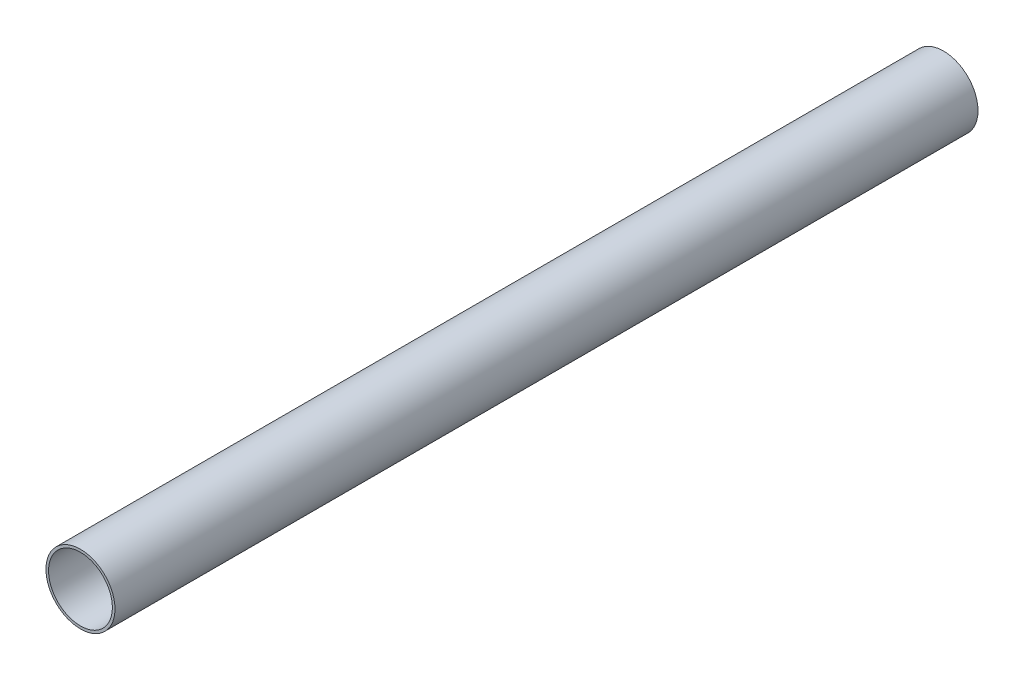
ISO-10303-21;
HEADER;
FILE_DESCRIPTION(('STEP AP214'),'2;1');
FILE_NAME('part.step','',(''),(''),'','','');
FILE_SCHEMA(('AUTOMOTIVE_DESIGN { 1 0 10303 214 1 1 1 1 }'));
ENDSEC;
DATA;
#1=APPLICATION_CONTEXT('core data for automotive mechanical design processes');
#2=APPLICATION_PROTOCOL_DEFINITION('international standard','automotive_design',2000,#1);
#3=PRODUCT_CONTEXT('',#1,'mechanical');
#4=PRODUCT('Part','Part','',(#3));
#5=PRODUCT_RELATED_PRODUCT_CATEGORY('part','',(#4));
#6=PRODUCT_DEFINITION_FORMATION('','',#4);
#7=PRODUCT_DEFINITION_CONTEXT('part definition',#1,'design');
#8=PRODUCT_DEFINITION('design','',#6,#7);
#9=PRODUCT_DEFINITION_SHAPE('','',#8);
#10=(LENGTH_UNIT() NAMED_UNIT(*) SI_UNIT(.MILLI.,.METRE.));
#11=(NAMED_UNIT(*) PLANE_ANGLE_UNIT() SI_UNIT($,.RADIAN.));
#12=(NAMED_UNIT(*) SI_UNIT($,.STERADIAN.) SOLID_ANGLE_UNIT());
#13=UNCERTAINTY_MEASURE_WITH_UNIT(LENGTH_MEASURE(1.E-05),#10,'distance_accuracy_value','');
#14=(GEOMETRIC_REPRESENTATION_CONTEXT(3) GLOBAL_UNCERTAINTY_ASSIGNED_CONTEXT((#13)) GLOBAL_UNIT_ASSIGNED_CONTEXT((#10,
#11,#12)) REPRESENTATION_CONTEXT('',''));
#15=CARTESIAN_POINT('',(0.,0.,0.));
#16=DIRECTION('',(0.,0.,1.));
#17=DIRECTION('',(1.,0.,0.));
#18=AXIS2_PLACEMENT_3D('',#15,#16,#17);
#19=CARTESIAN_POINT('',(0.,0.,500.));
#20=DIRECTION('',(0.,0.,1.));
#21=DIRECTION('',(1.,0.,0.));
#22=AXIS2_PLACEMENT_3D('',#19,#20,#21);
#23=PLANE('',#22);
#24=CARTESIAN_POINT('',(0.,0.,500.));
#25=DIRECTION('',(0.,0.,1.));
#26=DIRECTION('',(1.,0.,0.));
#27=AXIS2_PLACEMENT_3D('',#24,#25,#26);
#28=CIRCLE('',#27,20.);
#29=CARTESIAN_POINT('',(20.,0.,500.));
#30=VERTEX_POINT('',#29);
#31=EDGE_CURVE('E10',#30,#30,#28,.T.);
#32=ORIENTED_EDGE('',*,*,#31,.T.);
#33=EDGE_LOOP('',(#32));
#34=FACE_BOUND('',#33,.T.);
#35=CARTESIAN_POINT('',(0.,0.,500.));
#36=DIRECTION('',(0.,0.,1.));
#37=DIRECTION('',(1.,0.,0.));
#38=AXIS2_PLACEMENT_3D('',#35,#36,#37);
#39=CIRCLE('',#38,18.5);
#40=CARTESIAN_POINT('',(18.5,0.,500.));
#41=VERTEX_POINT('',#40);
#42=EDGE_CURVE('E50',#41,#41,#39,.T.);
#43=ORIENTED_EDGE('',*,*,#42,.F.);
#44=EDGE_LOOP('',(#43));
#45=FACE_BOUND('',#44,.T.);
#46=ADVANCED_FACE('F37',(#34,#45),#23,.T.);
#47=CARTESIAN_POINT('',(0.,0.,0.));
#48=DIRECTION('',(0.,0.,1.));
#49=DIRECTION('',(1.,0.,0.));
#50=AXIS2_PLACEMENT_3D('',#47,#48,#49);
#51=PLANE('',#50);
#52=CARTESIAN_POINT('',(0.,0.,0.));
#53=DIRECTION('',(0.,0.,1.));
#54=DIRECTION('',(1.,0.,0.));
#55=AXIS2_PLACEMENT_3D('',#52,#53,#54);
#56=CIRCLE('',#55,20.);
#57=CARTESIAN_POINT('',(20.,0.,0.));
#58=VERTEX_POINT('',#57);
#59=EDGE_CURVE('E41',#58,#58,#56,.T.);
#60=ORIENTED_EDGE('',*,*,#59,.F.);
#61=EDGE_LOOP('',(#60));
#62=FACE_BOUND('',#61,.T.);
#63=CARTESIAN_POINT('',(0.,0.,0.));
#64=DIRECTION('',(0.,0.,1.));
#65=DIRECTION('',(1.,0.,0.));
#66=AXIS2_PLACEMENT_3D('',#63,#64,#65);
#67=CIRCLE('',#66,18.5);
#68=CARTESIAN_POINT('',(18.5,0.,0.));
#69=VERTEX_POINT('',#68);
#70=EDGE_CURVE('E52',#69,#69,#67,.T.);
#71=ORIENTED_EDGE('',*,*,#70,.T.);
#72=EDGE_LOOP('',(#71));
#73=FACE_BOUND('',#72,.T.);
#74=ADVANCED_FACE('F64',(#62,#73),#51,.F.);
#75=CARTESIAN_POINT('',(0.,0.,500.));
#76=DIRECTION('',(0.,0.,-1.));
#77=DIRECTION('',(-1.,0.,0.));
#78=AXIS2_PLACEMENT_3D('',#75,#76,#77);
#79=CYLINDRICAL_SURFACE('',#78,20.);
#80=ORIENTED_EDGE('',*,*,#31,.F.);
#81=EDGE_LOOP('',(#80));
#82=FACE_BOUND('',#81,.T.);
#83=ORIENTED_EDGE('',*,*,#59,.T.);
#84=EDGE_LOOP('',(#83));
#85=FACE_BOUND('',#84,.T.);
#86=ADVANCED_FACE('F39',(#82,#85),#79,.T.);
#87=CARTESIAN_POINT('',(0.,0.,500.));
#88=DIRECTION('',(0.,0.,-1.));
#89=DIRECTION('',(-1.,0.,0.));
#90=AXIS2_PLACEMENT_3D('',#87,#88,#89);
#91=CYLINDRICAL_SURFACE('',#90,18.5);
#92=ORIENTED_EDGE('',*,*,#42,.T.);
#93=EDGE_LOOP('',(#92));
#94=FACE_BOUND('',#93,.T.);
#95=ORIENTED_EDGE('',*,*,#70,.F.);
#96=EDGE_LOOP('',(#95));
#97=FACE_BOUND('',#96,.T.);
#98=ADVANCED_FACE('F60',(#94,#97),#91,.F.);
#99=CLOSED_SHELL('',(#46,#74,#86,#98));
#100=MANIFOLD_SOLID_BREP('B2',#99);
#101=ADVANCED_BREP_SHAPE_REPRESENTATION('',(#18,#100),#14);
#102=SHAPE_DEFINITION_REPRESENTATION(#9,#101);
ENDSEC;
END-ISO-10303-21;
